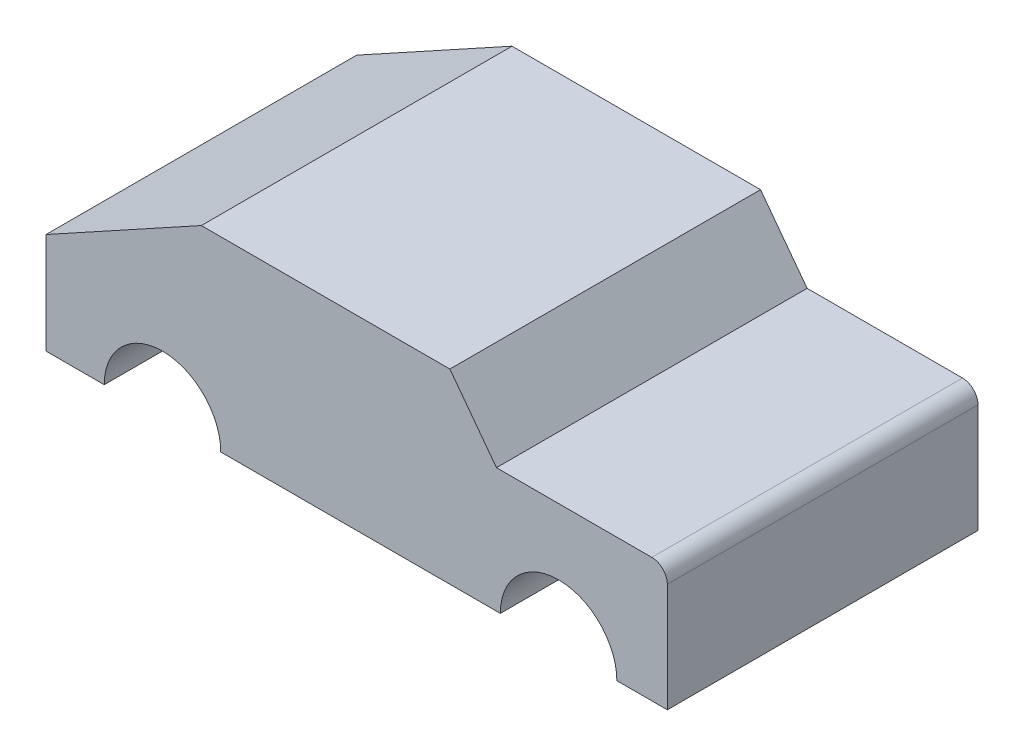
ISO-10303-21;
HEADER;
FILE_DESCRIPTION(('STEP AP214'),'2;1');
FILE_NAME('part.step','',(''),(''),'','','');
FILE_SCHEMA(('AUTOMOTIVE_DESIGN { 1 0 10303 214 1 1 1 1 }'));
ENDSEC;
DATA;
#1=APPLICATION_CONTEXT('core data for automotive mechanical design processes');
#2=APPLICATION_PROTOCOL_DEFINITION('international standard','automotive_design',2000,#1);
#3=PRODUCT_CONTEXT('',#1,'mechanical');
#4=PRODUCT('Part','Part','',(#3));
#5=PRODUCT_RELATED_PRODUCT_CATEGORY('part','',(#4));
#6=PRODUCT_DEFINITION_FORMATION('','',#4);
#7=PRODUCT_DEFINITION_CONTEXT('part definition',#1,'design');
#8=PRODUCT_DEFINITION('design','',#6,#7);
#9=PRODUCT_DEFINITION_SHAPE('','',#8);
#10=(LENGTH_UNIT() NAMED_UNIT(*) SI_UNIT(.MILLI.,.METRE.));
#11=(NAMED_UNIT(*) PLANE_ANGLE_UNIT() SI_UNIT($,.RADIAN.));
#12=(NAMED_UNIT(*) SI_UNIT($,.STERADIAN.) SOLID_ANGLE_UNIT());
#13=UNCERTAINTY_MEASURE_WITH_UNIT(LENGTH_MEASURE(1.E-05),#10,'distance_accuracy_value','');
#14=(GEOMETRIC_REPRESENTATION_CONTEXT(3) GLOBAL_UNCERTAINTY_ASSIGNED_CONTEXT((#13)) GLOBAL_UNIT_ASSIGNED_CONTEXT((#10,
#11,#12)) REPRESENTATION_CONTEXT('',''));
#15=CARTESIAN_POINT('',(0.,0.,0.));
#16=DIRECTION('',(0.,0.,1.));
#17=DIRECTION('',(1.,0.,0.));
#18=AXIS2_PLACEMENT_3D('',#15,#16,#17);
#19=CARTESIAN_POINT('',(-294.5819112628,-54.8810807660215,-199.999999999998));
#20=DIRECTION('',(0.,1.,0.));
#21=DIRECTION('',(0.,0.,-1.));
#22=AXIS2_PLACEMENT_3D('',#19,#20,#21);
#23=PLANE('',#22);
#24=DIRECTION('',(-1.,0.,0.));
#25=VECTOR('',#24,1.);
#26=CARTESIAN_POINT('',(-294.581911262799,-54.8810807660215,2.05705449186961E-12));
#27=LINE('',#26,#25);
#28=CARTESIAN_POINT('',(-294.581911262799,-54.8810807660215,2.05705449186961E-12));
#29=VERTEX_POINT('',#28);
#30=CARTESIAN_POINT('',(-332.081911262799,-54.8810807660215,2.31891559228285E-12));
#31=VERTEX_POINT('',#30);
#32=EDGE_CURVE('E155',#29,#31,#27,.T.);
#33=ORIENTED_EDGE('',*,*,#32,.T.);
#34=DIRECTION('',(0.,0.,1.));
#35=VECTOR('',#34,1.);
#36=CARTESIAN_POINT('',(-332.0819112628,-54.8810807660215,-199.999999999998));
#37=LINE('',#36,#35);
#38=CARTESIAN_POINT('',(-332.0819112628,-54.8810807660215,-199.999999999998));
#39=VERTEX_POINT('',#38);
#40=EDGE_CURVE('E11',#39,#31,#37,.T.);
#41=ORIENTED_EDGE('',*,*,#40,.F.);
#42=DIRECTION('',(-1.,0.,0.));
#43=VECTOR('',#42,1.);
#44=CARTESIAN_POINT('',(-294.5819112628,-54.8810807660215,-199.999999999998));
#45=LINE('',#44,#43);
#46=CARTESIAN_POINT('',(-294.5819112628,-54.8810807660215,-199.999999999998));
#47=VERTEX_POINT('',#46);
#48=EDGE_CURVE('E177',#47,#39,#45,.T.);
#49=ORIENTED_EDGE('',*,*,#48,.F.);
#50=DIRECTION('',(0.,0.,1.));
#51=VECTOR('',#50,1.);
#52=CARTESIAN_POINT('',(-294.5819112628,-54.8810807660215,-199.999999999998));
#53=LINE('',#52,#51);
#54=EDGE_CURVE('E151',#47,#29,#53,.T.);
#55=ORIENTED_EDGE('',*,*,#54,.T.);
#56=EDGE_LOOP('',(#33,#41,#49,#55));
#57=FACE_BOUND('',#56,.T.);
#58=ADVANCED_FACE('F35',(#57),#23,.F.);
#59=CARTESIAN_POINT('',(-332.0819112628,10.1189192339786,-199.999999999998));
#60=DIRECTION('',(1.,0.,0.));
#61=DIRECTION('',(0.,-1.,0.));
#62=AXIS2_PLACEMENT_3D('',#59,#60,#61);
#63=PLANE('',#62);
#64=DIRECTION('',(0.,1.,0.));
#65=VECTOR('',#64,1.);
#66=CARTESIAN_POINT('',(-332.081911262799,10.1189192339786,2.31891559228285E-12));
#67=LINE('',#66,#65);
#68=CARTESIAN_POINT('',(-332.081911262799,10.1189192339786,2.31891559228285E-12));
#69=VERTEX_POINT('',#68);
#70=EDGE_CURVE('E158',#31,#69,#67,.T.);
#71=ORIENTED_EDGE('',*,*,#70,.T.);
#72=DIRECTION('',(0.,0.,1.));
#73=VECTOR('',#72,1.);
#74=CARTESIAN_POINT('',(-332.0819112628,10.1189192339786,-199.999999999998));
#75=LINE('',#74,#73);
#76=CARTESIAN_POINT('',(-332.0819112628,10.1189192339786,-199.999999999998));
#77=VERTEX_POINT('',#76);
#78=EDGE_CURVE('E43',#77,#69,#75,.T.);
#79=ORIENTED_EDGE('',*,*,#78,.F.);
#80=DIRECTION('',(0.,1.,0.));
#81=VECTOR('',#80,1.);
#82=CARTESIAN_POINT('',(-332.0819112628,10.1189192339786,-199.999999999998));
#83=LINE('',#82,#81);
#84=EDGE_CURVE('E106',#39,#77,#83,.T.);
#85=ORIENTED_EDGE('',*,*,#84,.F.);
#86=ORIENTED_EDGE('',*,*,#40,.T.);
#87=EDGE_LOOP('',(#71,#79,#85,#86));
#88=FACE_BOUND('',#87,.T.);
#89=ADVANCED_FACE('F255',(#88),#63,.F.);
#90=CARTESIAN_POINT('',(-332.0819112628,10.1189192339786,-199.999999999998));
#91=DIRECTION('',(0.481918749772156,-0.876215908676647,0.));
#92=DIRECTION('',(-0.876215908676647,-0.481918749772156,0.));
#93=AXIS2_PLACEMENT_3D('',#90,#91,#92);
#94=PLANE('',#93);
#95=DIRECTION('',(0.876215908676647,0.481918749772156,0.));
#96=VECTOR('',#95,1.);
#97=CARTESIAN_POINT('',(-332.081911262799,10.1189192339786,2.31891559228285E-12));
#98=LINE('',#97,#96);
#99=CARTESIAN_POINT('',(-232.081911262799,65.1189192339786,1.62061932451422E-12));
#100=VERTEX_POINT('',#99);
#101=EDGE_CURVE('E160',#69,#100,#98,.T.);
#102=ORIENTED_EDGE('',*,*,#101,.T.);
#103=DIRECTION('',(0.,0.,1.));
#104=VECTOR('',#103,1.);
#105=CARTESIAN_POINT('',(-232.0819112628,65.1189192339786,-199.999999999998));
#106=LINE('',#105,#104);
#107=CARTESIAN_POINT('',(-232.0819112628,65.1189192339786,-199.999999999998));
#108=VERTEX_POINT('',#107);
#109=EDGE_CURVE('E196',#108,#100,#106,.T.);
#110=ORIENTED_EDGE('',*,*,#109,.F.);
#111=DIRECTION('',(0.876215908676647,0.481918749772156,0.));
#112=VECTOR('',#111,1.);
#113=CARTESIAN_POINT('',(-332.0819112628,10.1189192339786,-199.999999999998));
#114=LINE('',#113,#112);
#115=EDGE_CURVE('E204',#77,#108,#114,.T.);
#116=ORIENTED_EDGE('',*,*,#115,.F.);
#117=ORIENTED_EDGE('',*,*,#78,.T.);
#118=EDGE_LOOP('',(#102,#110,#116,#117));
#119=FACE_BOUND('',#118,.T.);
#120=ADVANCED_FACE('F202',(#119),#94,.F.);
#121=CARTESIAN_POINT('',(-232.0819112628,65.1189192339786,-199.999999999998));
#122=DIRECTION('',(0.,-1.,0.));
#123=DIRECTION('',(-1.,0.,0.));
#124=AXIS2_PLACEMENT_3D('',#121,#122,#123);
#125=PLANE('',#124);
#126=DIRECTION('',(1.,0.,0.));
#127=VECTOR('',#126,1.);
#128=CARTESIAN_POINT('',(-232.081911262799,65.1189192339786,1.62061932451422E-12));
#129=LINE('',#128,#127);
#130=CARTESIAN_POINT('',(-72.0819112627986,65.1189192339786,5.03345296084416E-13));
#131=VERTEX_POINT('',#130);
#132=EDGE_CURVE('E162',#100,#131,#129,.T.);
#133=ORIENTED_EDGE('',*,*,#132,.T.);
#134=DIRECTION('',(0.,0.,1.));
#135=VECTOR('',#134,1.);
#136=CARTESIAN_POINT('',(-72.0819112628,65.1189192339786,-200.));
#137=LINE('',#136,#135);
#138=CARTESIAN_POINT('',(-72.0819112628,65.1189192339786,-200.));
#139=VERTEX_POINT('',#138);
#140=EDGE_CURVE('E193',#139,#131,#137,.T.);
#141=ORIENTED_EDGE('',*,*,#140,.F.);
#142=DIRECTION('',(1.,0.,0.));
#143=VECTOR('',#142,1.);
#144=CARTESIAN_POINT('',(-232.0819112628,65.1189192339786,-199.999999999998));
#145=LINE('',#144,#143);
#146=EDGE_CURVE('E222',#108,#139,#145,.T.);
#147=ORIENTED_EDGE('',*,*,#146,.F.);
#148=ORIENTED_EDGE('',*,*,#109,.T.);
#149=EDGE_LOOP('',(#133,#141,#147,#148));
#150=FACE_BOUND('',#149,.T.);
#151=ADVANCED_FACE('F213',(#150),#125,.F.);
#152=CARTESIAN_POINT('',(-72.0819112628,65.1189192339786,-200.));
#153=DIRECTION('',(-0.8,-0.6,0.));
#154=DIRECTION('',(-0.6,0.8,0.));
#155=AXIS2_PLACEMENT_3D('',#152,#153,#154);
#156=PLANE('',#155);
#157=DIRECTION('',(0.6,-0.8,0.));
#158=VECTOR('',#157,1.);
#159=CARTESIAN_POINT('',(-72.0819112627986,65.1189192339786,5.03345296084416E-13));
#160=LINE('',#159,#158);
#161=CARTESIAN_POINT('',(-42.0819112627986,25.1189192339786,2.93856415753828E-13));
#162=VERTEX_POINT('',#161);
#163=EDGE_CURVE('E164',#131,#162,#160,.T.);
#164=ORIENTED_EDGE('',*,*,#163,.T.);
#165=DIRECTION('',(0.,0.,1.));
#166=VECTOR('',#165,1.);
#167=CARTESIAN_POINT('',(-42.0819112628,25.1189192339786,-200.));
#168=LINE('',#167,#166);
#169=CARTESIAN_POINT('',(-42.0819112628,25.1189192339786,-200.));
#170=VERTEX_POINT('',#169);
#171=EDGE_CURVE('E190',#170,#162,#168,.T.);
#172=ORIENTED_EDGE('',*,*,#171,.F.);
#173=DIRECTION('',(0.6,-0.8,0.));
#174=VECTOR('',#173,1.);
#175=CARTESIAN_POINT('',(-72.0819112628,65.1189192339786,-200.));
#176=LINE('',#175,#174);
#177=EDGE_CURVE('E219',#139,#170,#176,.T.);
#178=ORIENTED_EDGE('',*,*,#177,.F.);
#179=ORIENTED_EDGE('',*,*,#140,.T.);
#180=EDGE_LOOP('',(#164,#172,#178,#179));
#181=FACE_BOUND('',#180,.T.);
#182=ADVANCED_FACE('F217',(#181),#156,.F.);
#183=CARTESIAN_POINT('',(-42.0819112628,25.1189192339786,-200.));
#184=DIRECTION('',(0.,-1.,0.));
#185=DIRECTION('',(-1.,0.,0.));
#186=AXIS2_PLACEMENT_3D('',#183,#184,#185);
#187=PLANE('',#186);
#188=DIRECTION('',(1.,0.,0.));
#189=VECTOR('',#188,1.);
#190=CARTESIAN_POINT('',(-42.0819112627986,25.1189192339786,2.93856415753828E-13));
#191=LINE('',#190,#189);
#192=CARTESIAN_POINT('',(57.9180887372014,25.1189192339785,-4.04439852014798E-13));
#193=VERTEX_POINT('',#192);
#194=EDGE_CURVE('E166',#162,#193,#191,.T.);
#195=ORIENTED_EDGE('',*,*,#194,.T.);
#196=DIRECTION('',(0.,0.,1.));
#197=VECTOR('',#196,1.);
#198=CARTESIAN_POINT('',(57.9180887372,25.1189192339785,-200.));
#199=LINE('',#198,#197);
#200=CARTESIAN_POINT('',(57.9180887372,25.1189192339785,-200.));
#201=VERTEX_POINT('',#200);
#202=EDGE_CURVE('E187',#201,#193,#199,.T.);
#203=ORIENTED_EDGE('',*,*,#202,.F.);
#204=DIRECTION('',(1.,0.,0.));
#205=VECTOR('',#204,1.);
#206=CARTESIAN_POINT('',(-42.0819112628,25.1189192339786,-200.));
#207=LINE('',#206,#205);
#208=EDGE_CURVE('E221',#170,#201,#207,.T.);
#209=ORIENTED_EDGE('',*,*,#208,.F.);
#210=ORIENTED_EDGE('',*,*,#171,.T.);
#211=EDGE_LOOP('',(#195,#203,#209,#210));
#212=FACE_BOUND('',#211,.T.);
#213=ADVANCED_FACE('F268',(#212),#187,.F.);
#214=CARTESIAN_POINT('',(57.9180887372,15.1189192339785,-200.));
#215=DIRECTION('',(0.,0.,1.));
#216=DIRECTION('',(1.,0.,0.));
#217=AXIS2_PLACEMENT_3D('',#214,#215,#216);
#218=CYLINDRICAL_SURFACE('',#217,10.);
#219=CARTESIAN_POINT('',(57.9180887372014,15.1189192339785,-4.04439852014798E-13));
#220=DIRECTION('',(0.,0.,-1.));
#221=DIRECTION('',(-1.,0.,0.));
#222=AXIS2_PLACEMENT_3D('',#219,#220,#221);
#223=CIRCLE('',#222,10.);
#224=CARTESIAN_POINT('',(67.9180887372014,15.1189192339785,-4.74269478791661E-13));
#225=VERTEX_POINT('',#224);
#226=EDGE_CURVE('E168',#193,#225,#223,.T.);
#227=ORIENTED_EDGE('',*,*,#226,.T.);
#228=DIRECTION('',(0.,0.,1.));
#229=VECTOR('',#228,1.);
#230=CARTESIAN_POINT('',(67.9180887372,15.1189192339785,-200.));
#231=LINE('',#230,#229);
#232=CARTESIAN_POINT('',(67.9180887372,15.1189192339785,-200.));
#233=VERTEX_POINT('',#232);
#234=EDGE_CURVE('E184',#233,#225,#231,.T.);
#235=ORIENTED_EDGE('',*,*,#234,.F.);
#236=CARTESIAN_POINT('',(57.9180887372,15.1189192339785,-200.));
#237=DIRECTION('',(0.,0.,-1.));
#238=DIRECTION('',(-1.,0.,0.));
#239=AXIS2_PLACEMENT_3D('',#236,#237,#238);
#240=CIRCLE('',#239,10.);
#241=EDGE_CURVE('E224',#201,#233,#240,.T.);
#242=ORIENTED_EDGE('',*,*,#241,.F.);
#243=ORIENTED_EDGE('',*,*,#202,.T.);
#244=EDGE_LOOP('',(#227,#235,#242,#243));
#245=FACE_BOUND('',#244,.T.);
#246=ADVANCED_FACE('F271',(#245),#218,.T.);
#247=CARTESIAN_POINT('',(67.9180887372,15.1189192339785,-200.));
#248=DIRECTION('',(-1.,0.,0.));
#249=DIRECTION('',(0.,0.,1.));
#250=AXIS2_PLACEMENT_3D('',#247,#248,#249);
#251=PLANE('',#250);
#252=DIRECTION('',(0.,-1.,0.));
#253=VECTOR('',#252,1.);
#254=CARTESIAN_POINT('',(67.9180887372014,15.1189192339785,-4.74269478791661E-13));
#255=LINE('',#254,#253);
#256=CARTESIAN_POINT('',(67.9180887372014,-54.8810807660215,-4.74269478791661E-13));
#257=VERTEX_POINT('',#256);
#258=EDGE_CURVE('E170',#225,#257,#255,.T.);
#259=ORIENTED_EDGE('',*,*,#258,.T.);
#260=DIRECTION('',(0.,0.,1.));
#261=VECTOR('',#260,1.);
#262=CARTESIAN_POINT('',(67.9180887372,-54.8810807660215,-200.));
#263=LINE('',#262,#261);
#264=CARTESIAN_POINT('',(67.9180887372,-54.8810807660215,-200.));
#265=VERTEX_POINT('',#264);
#266=EDGE_CURVE('E181',#265,#257,#263,.T.);
#267=ORIENTED_EDGE('',*,*,#266,.F.);
#268=DIRECTION('',(0.,-1.,0.));
#269=VECTOR('',#268,1.);
#270=CARTESIAN_POINT('',(67.9180887372,15.1189192339785,-200.));
#271=LINE('',#270,#269);
#272=EDGE_CURVE('E230',#233,#265,#271,.T.);
#273=ORIENTED_EDGE('',*,*,#272,.F.);
#274=ORIENTED_EDGE('',*,*,#234,.T.);
#275=EDGE_LOOP('',(#259,#267,#273,#274));
#276=FACE_BOUND('',#275,.T.);
#277=ADVANCED_FACE('F236',(#276),#251,.F.);
#278=CARTESIAN_POINT('',(67.9180887372,-54.8810807660215,-200.));
#279=DIRECTION('',(0.,1.,0.));
#280=DIRECTION('',(0.,0.,-1.));
#281=AXIS2_PLACEMENT_3D('',#278,#279,#280);
#282=PLANE('',#281);
#283=DIRECTION('',(-1.,0.,0.));
#284=VECTOR('',#283,1.);
#285=CARTESIAN_POINT('',(67.9180887372014,-54.8810807660215,-4.74269478791661E-13));
#286=LINE('',#285,#284);
#287=CARTESIAN_POINT('',(35.4180887372014,-54.8810807660215,-2.47323191766857E-13));
#288=VERTEX_POINT('',#287);
#289=EDGE_CURVE('E172',#257,#288,#286,.T.);
#290=ORIENTED_EDGE('',*,*,#289,.T.);
#291=DIRECTION('',(0.,0.,1.));
#292=VECTOR('',#291,1.);
#293=CARTESIAN_POINT('',(35.4180887372,-54.8810807660215,-200.));
#294=LINE('',#293,#292);
#295=CARTESIAN_POINT('',(35.4180887372,-54.8810807660215,-200.));
#296=VERTEX_POINT('',#295);
#297=EDGE_CURVE('E146',#296,#288,#294,.T.);
#298=ORIENTED_EDGE('',*,*,#297,.F.);
#299=DIRECTION('',(-1.,0.,0.));
#300=VECTOR('',#299,1.);
#301=CARTESIAN_POINT('',(67.9180887372,-54.8810807660215,-200.));
#302=LINE('',#301,#300);
#303=EDGE_CURVE('E137',#265,#296,#302,.T.);
#304=ORIENTED_EDGE('',*,*,#303,.F.);
#305=ORIENTED_EDGE('',*,*,#266,.T.);
#306=EDGE_LOOP('',(#290,#298,#304,#305));
#307=FACE_BOUND('',#306,.T.);
#308=ADVANCED_FACE('F240',(#307),#282,.F.);
#309=CARTESIAN_POINT('',(-2.08191126280005,-54.8810807660215,-200.));
#310=DIRECTION('',(0.,0.,1.));
#311=DIRECTION('',(1.,0.,0.));
#312=AXIS2_PLACEMENT_3D('',#309,#310,#311);
#313=CYLINDRICAL_SURFACE('',#312,37.5);
#314=CARTESIAN_POINT('',(-2.08191126279865,-54.8810807660215,0.));
#315=DIRECTION('',(0.,0.,1.));
#316=DIRECTION('',(-1.,0.,0.));
#317=AXIS2_PLACEMENT_3D('',#314,#315,#316);
#318=CIRCLE('',#317,37.5);
#319=CARTESIAN_POINT('',(-39.5819112627986,-54.8810807660215,2.76399009059613E-13));
#320=VERTEX_POINT('',#319);
#321=EDGE_CURVE('E145',#288,#320,#318,.T.);
#322=ORIENTED_EDGE('',*,*,#321,.T.);
#323=DIRECTION('',(0.,0.,1.));
#324=VECTOR('',#323,1.);
#325=CARTESIAN_POINT('',(-39.5819112628,-54.8810807660215,-200.));
#326=LINE('',#325,#324);
#327=CARTESIAN_POINT('',(-39.5819112628,-54.8810807660215,-200.));
#328=VERTEX_POINT('',#327);
#329=EDGE_CURVE('E142',#328,#320,#326,.T.);
#330=ORIENTED_EDGE('',*,*,#329,.F.);
#331=CARTESIAN_POINT('',(-2.08191126280005,-54.8810807660215,-200.));
#332=DIRECTION('',(0.,0.,1.));
#333=DIRECTION('',(-1.,0.,0.));
#334=AXIS2_PLACEMENT_3D('',#331,#332,#333);
#335=CIRCLE('',#334,37.5);
#336=EDGE_CURVE('E131',#296,#328,#335,.T.);
#337=ORIENTED_EDGE('',*,*,#336,.F.);
#338=ORIENTED_EDGE('',*,*,#297,.T.);
#339=EDGE_LOOP('',(#322,#330,#337,#338));
#340=FACE_BOUND('',#339,.T.);
#341=ADVANCED_FACE('F143',(#340),#313,.F.);
#342=CARTESIAN_POINT('',(-39.5819112628,-54.8810807660215,-200.));
#343=DIRECTION('',(0.,1.,0.));
#344=DIRECTION('',(1.,0.,0.));
#345=AXIS2_PLACEMENT_3D('',#342,#343,#344);
#346=PLANE('',#345);
#347=DIRECTION('',(-1.,0.,0.));
#348=VECTOR('',#347,1.);
#349=CARTESIAN_POINT('',(-39.5819112627986,-54.8810807660215,2.76399009059613E-13));
#350=LINE('',#349,#348);
#351=CARTESIAN_POINT('',(-219.581911262799,-54.8810807660215,1.53333229104314E-12));
#352=VERTEX_POINT('',#351);
#353=EDGE_CURVE('E92',#320,#352,#350,.T.);
#354=ORIENTED_EDGE('',*,*,#353,.T.);
#355=DIRECTION('',(0.,0.,1.));
#356=VECTOR('',#355,1.);
#357=CARTESIAN_POINT('',(-219.5819112628,-54.8810807660215,-199.999999999998));
#358=LINE('',#357,#356);
#359=CARTESIAN_POINT('',(-219.5819112628,-54.8810807660215,-199.999999999998));
#360=VERTEX_POINT('',#359);
#361=EDGE_CURVE('E147',#360,#352,#358,.T.);
#362=ORIENTED_EDGE('',*,*,#361,.F.);
#363=DIRECTION('',(-1.,0.,0.));
#364=VECTOR('',#363,1.);
#365=CARTESIAN_POINT('',(-39.5819112628,-54.8810807660215,-200.));
#366=LINE('',#365,#364);
#367=EDGE_CURVE('E135',#328,#360,#366,.T.);
#368=ORIENTED_EDGE('',*,*,#367,.F.);
#369=ORIENTED_EDGE('',*,*,#329,.T.);
#370=EDGE_LOOP('',(#354,#362,#368,#369));
#371=FACE_BOUND('',#370,.T.);
#372=ADVANCED_FACE('F149',(#371),#346,.F.);
#373=CARTESIAN_POINT('',(-257.0819112628,-54.8810807660215,-199.999999999998));
#374=DIRECTION('',(0.,0.,1.));
#375=DIRECTION('',(1.,0.,0.));
#376=AXIS2_PLACEMENT_3D('',#373,#374,#375);
#377=CYLINDRICAL_SURFACE('',#376,37.5);
#378=CARTESIAN_POINT('',(-257.081911262799,-54.8810807660215,1.79519339145638E-12));
#379=DIRECTION('',(0.,0.,1.));
#380=DIRECTION('',(-1.,0.,0.));
#381=AXIS2_PLACEMENT_3D('',#378,#379,#380);
#382=CIRCLE('',#381,37.5);
#383=EDGE_CURVE('E98',#352,#29,#382,.T.);
#384=ORIENTED_EDGE('',*,*,#383,.T.);
#385=ORIENTED_EDGE('',*,*,#54,.F.);
#386=CARTESIAN_POINT('',(-257.0819112628,-54.8810807660215,-199.999999999998));
#387=DIRECTION('',(0.,0.,1.));
#388=DIRECTION('',(-1.,0.,0.));
#389=AXIS2_PLACEMENT_3D('',#386,#387,#388);
#390=CIRCLE('',#389,37.5);
#391=EDGE_CURVE('E51',#360,#47,#390,.T.);
#392=ORIENTED_EDGE('',*,*,#391,.F.);
#393=ORIENTED_EDGE('',*,*,#361,.T.);
#394=EDGE_LOOP('',(#384,#385,#392,#393));
#395=FACE_BOUND('',#394,.T.);
#396=ADVANCED_FACE('F244',(#395),#377,.F.);
#397=CARTESIAN_POINT('',(57.9180887372,15.1189192339785,-200.));
#398=DIRECTION('',(0.,0.,-1.));
#399=DIRECTION('',(-1.,0.,0.));
#400=AXIS2_PLACEMENT_3D('',#397,#398,#399);
#401=PLANE('',#400);
#402=ORIENTED_EDGE('',*,*,#48,.T.);
#403=ORIENTED_EDGE('',*,*,#84,.T.);
#404=ORIENTED_EDGE('',*,*,#115,.T.);
#405=ORIENTED_EDGE('',*,*,#146,.T.);
#406=ORIENTED_EDGE('',*,*,#177,.T.);
#407=ORIENTED_EDGE('',*,*,#208,.T.);
#408=ORIENTED_EDGE('',*,*,#241,.T.);
#409=ORIENTED_EDGE('',*,*,#272,.T.);
#410=ORIENTED_EDGE('',*,*,#303,.T.);
#411=ORIENTED_EDGE('',*,*,#336,.T.);
#412=ORIENTED_EDGE('',*,*,#367,.T.);
#413=ORIENTED_EDGE('',*,*,#391,.T.);
#414=EDGE_LOOP('',(#402,#403,#404,#405,#406,#407,#408,#409,#410,#411,#412,#413));
#415=FACE_BOUND('',#414,.T.);
#416=ADVANCED_FACE('F133',(#415),#401,.T.);
#417=CARTESIAN_POINT('',(57.9180887372014,15.1189192339785,-4.04439852014798E-13));
#418=DIRECTION('',(0.,0.,-1.));
#419=DIRECTION('',(-1.,0.,0.));
#420=AXIS2_PLACEMENT_3D('',#417,#418,#419);
#421=PLANE('',#420);
#422=ORIENTED_EDGE('',*,*,#32,.F.);
#423=ORIENTED_EDGE('',*,*,#383,.F.);
#424=ORIENTED_EDGE('',*,*,#353,.F.);
#425=ORIENTED_EDGE('',*,*,#321,.F.);
#426=ORIENTED_EDGE('',*,*,#289,.F.);
#427=ORIENTED_EDGE('',*,*,#258,.F.);
#428=ORIENTED_EDGE('',*,*,#226,.F.);
#429=ORIENTED_EDGE('',*,*,#194,.F.);
#430=ORIENTED_EDGE('',*,*,#163,.F.);
#431=ORIENTED_EDGE('',*,*,#132,.F.);
#432=ORIENTED_EDGE('',*,*,#101,.F.);
#433=ORIENTED_EDGE('',*,*,#70,.F.);
#434=EDGE_LOOP('',(#422,#423,#424,#425,#426,#427,#428,#429,#430,#431,#432,#433));
#435=FACE_BOUND('',#434,.T.);
#436=ADVANCED_FACE('F208',(#435),#421,.F.);
#437=CLOSED_SHELL('',(#58,#89,#120,#151,#182,#213,#246,#277,#308,#341,#372,#396,#416,#436));
#438=MANIFOLD_SOLID_BREP('B2',#437);
#439=ADVANCED_BREP_SHAPE_REPRESENTATION('',(#18,#438),#14);
#440=SHAPE_DEFINITION_REPRESENTATION(#9,#439);
ENDSEC;
END-ISO-10303-21;
